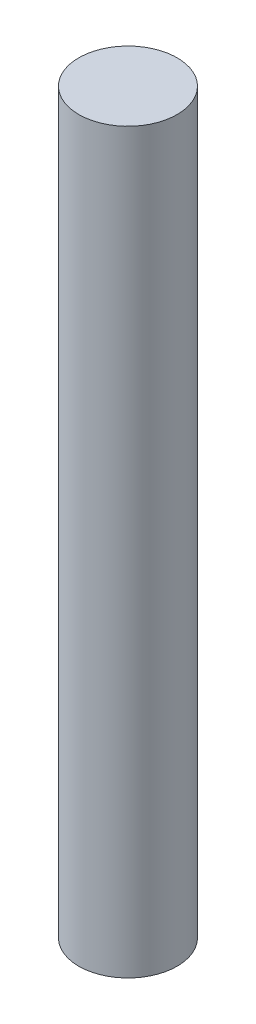
ISO-10303-21;
HEADER;
FILE_DESCRIPTION(('STEP AP214'),'2;1');
FILE_NAME('part.step','',(''),(''),'','','');
FILE_SCHEMA(('AUTOMOTIVE_DESIGN { 1 0 10303 214 1 1 1 1 }'));
ENDSEC;
DATA;
#1=APPLICATION_CONTEXT('core data for automotive mechanical design processes');
#2=APPLICATION_PROTOCOL_DEFINITION('international standard','automotive_design',2000,#1);
#3=PRODUCT_CONTEXT('',#1,'mechanical');
#4=PRODUCT('Part','Part','',(#3));
#5=PRODUCT_RELATED_PRODUCT_CATEGORY('part','',(#4));
#6=PRODUCT_DEFINITION_FORMATION('','',#4);
#7=PRODUCT_DEFINITION_CONTEXT('part definition',#1,'design');
#8=PRODUCT_DEFINITION('design','',#6,#7);
#9=PRODUCT_DEFINITION_SHAPE('','',#8);
#10=(LENGTH_UNIT() NAMED_UNIT(*) SI_UNIT(.MILLI.,.METRE.));
#11=(NAMED_UNIT(*) PLANE_ANGLE_UNIT() SI_UNIT($,.RADIAN.));
#12=(NAMED_UNIT(*) SI_UNIT($,.STERADIAN.) SOLID_ANGLE_UNIT());
#13=UNCERTAINTY_MEASURE_WITH_UNIT(LENGTH_MEASURE(1.E-05),#10,'distance_accuracy_value','');
#14=(GEOMETRIC_REPRESENTATION_CONTEXT(3) GLOBAL_UNCERTAINTY_ASSIGNED_CONTEXT((#13)) GLOBAL_UNIT_ASSIGNED_CONTEXT((#10,
#11,#12)) REPRESENTATION_CONTEXT('',''));
#15=CARTESIAN_POINT('',(0.,0.,0.));
#16=DIRECTION('',(0.,0.,1.));
#17=DIRECTION('',(1.,0.,0.));
#18=AXIS2_PLACEMENT_3D('',#15,#16,#17);
#19=CARTESIAN_POINT('',(0.,45.,0.));
#20=DIRECTION('',(0.,-1.,0.));
#21=DIRECTION('',(0.,0.,-1.));
#22=AXIS2_PLACEMENT_3D('',#19,#20,#21);
#23=CYLINDRICAL_SURFACE('',#22,3.);
#24=CARTESIAN_POINT('',(0.,45.,0.));
#25=DIRECTION('',(0.,1.,0.));
#26=DIRECTION('',(0.,0.,1.));
#27=AXIS2_PLACEMENT_3D('',#24,#25,#26);
#28=CIRCLE('',#27,3.);
#29=CARTESIAN_POINT('',(0.,45.,3.));
#30=VERTEX_POINT('',#29);
#31=EDGE_CURVE('E10',#30,#30,#28,.T.);
#32=ORIENTED_EDGE('',*,*,#31,.F.);
#33=EDGE_LOOP('',(#32));
#34=FACE_BOUND('',#33,.T.);
#35=CARTESIAN_POINT('',(0.,0.,0.));
#36=DIRECTION('',(0.,1.,0.));
#37=DIRECTION('',(0.,0.,1.));
#38=AXIS2_PLACEMENT_3D('',#35,#36,#37);
#39=CIRCLE('',#38,3.);
#40=CARTESIAN_POINT('',(0.,0.,3.));
#41=VERTEX_POINT('',#40);
#42=EDGE_CURVE('E34',#41,#41,#39,.T.);
#43=ORIENTED_EDGE('',*,*,#42,.T.);
#44=EDGE_LOOP('',(#43));
#45=FACE_BOUND('',#44,.T.);
#46=ADVANCED_FACE('F31',(#34,#45),#23,.T.);
#47=CARTESIAN_POINT('',(0.,45.,0.));
#48=DIRECTION('',(0.,1.,0.));
#49=DIRECTION('',(0.,0.,1.));
#50=AXIS2_PLACEMENT_3D('',#47,#48,#49);
#51=PLANE('',#50);
#52=ORIENTED_EDGE('',*,*,#31,.T.);
#53=EDGE_LOOP('',(#52));
#54=FACE_BOUND('',#53,.T.);
#55=ADVANCED_FACE('F46',(#54),#51,.T.);
#56=CARTESIAN_POINT('',(0.,0.,0.));
#57=DIRECTION('',(0.,1.,0.));
#58=DIRECTION('',(0.,0.,1.));
#59=AXIS2_PLACEMENT_3D('',#56,#57,#58);
#60=PLANE('',#59);
#61=ORIENTED_EDGE('',*,*,#42,.F.);
#62=EDGE_LOOP('',(#61));
#63=FACE_BOUND('',#62,.T.);
#64=ADVANCED_FACE('F44',(#63),#60,.F.);
#65=CLOSED_SHELL('',(#46,#55,#64));
#66=MANIFOLD_SOLID_BREP('B2',#65);
#67=ADVANCED_BREP_SHAPE_REPRESENTATION('',(#18,#66),#14);
#68=SHAPE_DEFINITION_REPRESENTATION(#9,#67);
ENDSEC;
END-ISO-10303-21;
